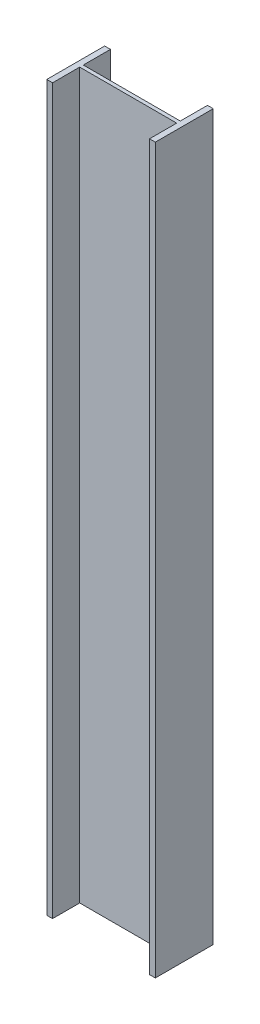
ISO-10303-21;
HEADER;
FILE_DESCRIPTION(('STEP AP214'),'2;1');
FILE_NAME('part.step','',(''),(''),'','','');
FILE_SCHEMA(('AUTOMOTIVE_DESIGN { 1 0 10303 214 1 1 1 1 }'));
ENDSEC;
DATA;
#1=APPLICATION_CONTEXT('core data for automotive mechanical design processes');
#2=APPLICATION_PROTOCOL_DEFINITION('international standard','automotive_design',2000,#1);
#3=PRODUCT_CONTEXT('',#1,'mechanical');
#4=PRODUCT('Part','Part','',(#3));
#5=PRODUCT_RELATED_PRODUCT_CATEGORY('part','',(#4));
#6=PRODUCT_DEFINITION_FORMATION('','',#4);
#7=PRODUCT_DEFINITION_CONTEXT('part definition',#1,'design');
#8=PRODUCT_DEFINITION('design','',#6,#7);
#9=PRODUCT_DEFINITION_SHAPE('','',#8);
#10=(LENGTH_UNIT() NAMED_UNIT(*) SI_UNIT(.MILLI.,.METRE.));
#11=(NAMED_UNIT(*) PLANE_ANGLE_UNIT() SI_UNIT($,.RADIAN.));
#12=(NAMED_UNIT(*) SI_UNIT($,.STERADIAN.) SOLID_ANGLE_UNIT());
#13=UNCERTAINTY_MEASURE_WITH_UNIT(LENGTH_MEASURE(1.E-05),#10,'distance_accuracy_value','');
#14=(GEOMETRIC_REPRESENTATION_CONTEXT(3) GLOBAL_UNCERTAINTY_ASSIGNED_CONTEXT((#13)) GLOBAL_UNIT_ASSIGNED_CONTEXT((#10,
#11,#12)) REPRESENTATION_CONTEXT('',''));
#15=CARTESIAN_POINT('',(0.,0.,0.));
#16=DIRECTION('',(0.,0.,1.));
#17=DIRECTION('',(1.,0.,0.));
#18=AXIS2_PLACEMENT_3D('',#15,#16,#17);
#19=CARTESIAN_POINT('',(67.,1000.,-2.5));
#20=DIRECTION('',(0.,0.,1.));
#21=DIRECTION('',(1.,0.,0.));
#22=AXIS2_PLACEMENT_3D('',#19,#20,#21);
#23=PLANE('',#22);
#24=DIRECTION('',(-1.,0.,0.));
#25=VECTOR('',#24,1.);
#26=CARTESIAN_POINT('',(67.,0.,-2.5));
#27=LINE('',#26,#25);
#28=CARTESIAN_POINT('',(67.,0.,-2.5));
#29=VERTEX_POINT('',#28);
#30=CARTESIAN_POINT('',(-67.,0.,-2.5));
#31=VERTEX_POINT('',#30);
#32=EDGE_CURVE('E156',#29,#31,#27,.T.);
#33=ORIENTED_EDGE('',*,*,#32,.T.);
#34=DIRECTION('',(0.,-1.,0.));
#35=VECTOR('',#34,1.);
#36=CARTESIAN_POINT('',(-67.,1000.,-2.5));
#37=LINE('',#36,#35);
#38=CARTESIAN_POINT('',(-67.,1000.,-2.5));
#39=VERTEX_POINT('',#38);
#40=EDGE_CURVE('E11',#39,#31,#37,.T.);
#41=ORIENTED_EDGE('',*,*,#40,.F.);
#42=DIRECTION('',(-1.,0.,0.));
#43=VECTOR('',#42,1.);
#44=CARTESIAN_POINT('',(67.,1000.,-2.5));
#45=LINE('',#44,#43);
#46=CARTESIAN_POINT('',(67.,1000.,-2.5));
#47=VERTEX_POINT('',#46);
#48=EDGE_CURVE('E178',#47,#39,#45,.T.);
#49=ORIENTED_EDGE('',*,*,#48,.F.);
#50=DIRECTION('',(0.,-1.,0.));
#51=VECTOR('',#50,1.);
#52=CARTESIAN_POINT('',(67.,1000.,-2.5));
#53=LINE('',#52,#51);
#54=EDGE_CURVE('E152',#47,#29,#53,.T.);
#55=ORIENTED_EDGE('',*,*,#54,.T.);
#56=EDGE_LOOP('',(#33,#41,#49,#55));
#57=FACE_BOUND('',#56,.T.);
#58=ADVANCED_FACE('F36',(#57),#23,.F.);
#59=CARTESIAN_POINT('',(-67.,1000.,-2.5));
#60=DIRECTION('',(-1.,0.,0.));
#61=DIRECTION('',(0.,0.,1.));
#62=AXIS2_PLACEMENT_3D('',#59,#60,#61);
#63=PLANE('',#62);
#64=DIRECTION('',(0.,0.,-1.));
#65=VECTOR('',#64,1.);
#66=CARTESIAN_POINT('',(-67.,0.,-2.5));
#67=LINE('',#66,#65);
#68=CARTESIAN_POINT('',(-67.,0.,-40.));
#69=VERTEX_POINT('',#68);
#70=EDGE_CURVE('E159',#31,#69,#67,.T.);
#71=ORIENTED_EDGE('',*,*,#70,.T.);
#72=DIRECTION('',(0.,-1.,0.));
#73=VECTOR('',#72,1.);
#74=CARTESIAN_POINT('',(-67.,1000.,-40.));
#75=LINE('',#74,#73);
#76=CARTESIAN_POINT('',(-67.,1000.,-40.));
#77=VERTEX_POINT('',#76);
#78=EDGE_CURVE('E44',#77,#69,#75,.T.);
#79=ORIENTED_EDGE('',*,*,#78,.F.);
#80=DIRECTION('',(0.,0.,-1.));
#81=VECTOR('',#80,1.);
#82=CARTESIAN_POINT('',(-67.,1000.,-2.5));
#83=LINE('',#82,#81);
#84=EDGE_CURVE('E107',#39,#77,#83,.T.);
#85=ORIENTED_EDGE('',*,*,#84,.F.);
#86=ORIENTED_EDGE('',*,*,#40,.T.);
#87=EDGE_LOOP('',(#71,#79,#85,#86));
#88=FACE_BOUND('',#87,.T.);
#89=ADVANCED_FACE('F256',(#88),#63,.F.);
#90=CARTESIAN_POINT('',(-67.,1000.,-40.));
#91=DIRECTION('',(0.,0.,1.));
#92=DIRECTION('',(1.,0.,0.));
#93=AXIS2_PLACEMENT_3D('',#90,#91,#92);
#94=PLANE('',#93);
#95=DIRECTION('',(-1.,0.,0.));
#96=VECTOR('',#95,1.);
#97=CARTESIAN_POINT('',(-67.,0.,-40.));
#98=LINE('',#97,#96);
#99=CARTESIAN_POINT('',(-75.,0.,-40.));
#100=VERTEX_POINT('',#99);
#101=EDGE_CURVE('E161',#69,#100,#98,.T.);
#102=ORIENTED_EDGE('',*,*,#101,.T.);
#103=DIRECTION('',(0.,-1.,0.));
#104=VECTOR('',#103,1.);
#105=CARTESIAN_POINT('',(-75.,1000.,-40.));
#106=LINE('',#105,#104);
#107=CARTESIAN_POINT('',(-75.,1000.,-40.));
#108=VERTEX_POINT('',#107);
#109=EDGE_CURVE('E197',#108,#100,#106,.T.);
#110=ORIENTED_EDGE('',*,*,#109,.F.);
#111=DIRECTION('',(-1.,0.,0.));
#112=VECTOR('',#111,1.);
#113=CARTESIAN_POINT('',(-67.,1000.,-40.));
#114=LINE('',#113,#112);
#115=EDGE_CURVE('E205',#77,#108,#114,.T.);
#116=ORIENTED_EDGE('',*,*,#115,.F.);
#117=ORIENTED_EDGE('',*,*,#78,.T.);
#118=EDGE_LOOP('',(#102,#110,#116,#117));
#119=FACE_BOUND('',#118,.T.);
#120=ADVANCED_FACE('F203',(#119),#94,.F.);
#121=CARTESIAN_POINT('',(-75.,1000.,-40.));
#122=DIRECTION('',(1.,0.,0.));
#123=DIRECTION('',(0.,0.,-1.));
#124=AXIS2_PLACEMENT_3D('',#121,#122,#123);
#125=PLANE('',#124);
#126=DIRECTION('',(0.,0.,1.));
#127=VECTOR('',#126,1.);
#128=CARTESIAN_POINT('',(-75.,0.,-40.));
#129=LINE('',#128,#127);
#130=CARTESIAN_POINT('',(-75.,0.,40.));
#131=VERTEX_POINT('',#130);
#132=EDGE_CURVE('E163',#100,#131,#129,.T.);
#133=ORIENTED_EDGE('',*,*,#132,.T.);
#134=DIRECTION('',(0.,-1.,0.));
#135=VECTOR('',#134,1.);
#136=CARTESIAN_POINT('',(-75.,1000.,40.));
#137=LINE('',#136,#135);
#138=CARTESIAN_POINT('',(-75.,1000.,40.));
#139=VERTEX_POINT('',#138);
#140=EDGE_CURVE('E194',#139,#131,#137,.T.);
#141=ORIENTED_EDGE('',*,*,#140,.F.);
#142=DIRECTION('',(0.,0.,1.));
#143=VECTOR('',#142,1.);
#144=CARTESIAN_POINT('',(-75.,1000.,-40.));
#145=LINE('',#144,#143);
#146=EDGE_CURVE('E223',#108,#139,#145,.T.);
#147=ORIENTED_EDGE('',*,*,#146,.F.);
#148=ORIENTED_EDGE('',*,*,#109,.T.);
#149=EDGE_LOOP('',(#133,#141,#147,#148));
#150=FACE_BOUND('',#149,.T.);
#151=ADVANCED_FACE('F214',(#150),#125,.F.);
#152=CARTESIAN_POINT('',(-75.,1000.,40.));
#153=DIRECTION('',(0.,0.,-1.));
#154=DIRECTION('',(-1.,0.,0.));
#155=AXIS2_PLACEMENT_3D('',#152,#153,#154);
#156=PLANE('',#155);
#157=DIRECTION('',(1.,0.,0.));
#158=VECTOR('',#157,1.);
#159=CARTESIAN_POINT('',(-75.,0.,40.));
#160=LINE('',#159,#158);
#161=CARTESIAN_POINT('',(-67.,0.,40.));
#162=VERTEX_POINT('',#161);
#163=EDGE_CURVE('E165',#131,#162,#160,.T.);
#164=ORIENTED_EDGE('',*,*,#163,.T.);
#165=DIRECTION('',(0.,-1.,0.));
#166=VECTOR('',#165,1.);
#167=CARTESIAN_POINT('',(-67.,1000.,40.));
#168=LINE('',#167,#166);
#169=CARTESIAN_POINT('',(-67.,1000.,40.));
#170=VERTEX_POINT('',#169);
#171=EDGE_CURVE('E191',#170,#162,#168,.T.);
#172=ORIENTED_EDGE('',*,*,#171,.F.);
#173=DIRECTION('',(1.,0.,0.));
#174=VECTOR('',#173,1.);
#175=CARTESIAN_POINT('',(-75.,1000.,40.));
#176=LINE('',#175,#174);
#177=EDGE_CURVE('E220',#139,#170,#176,.T.);
#178=ORIENTED_EDGE('',*,*,#177,.F.);
#179=ORIENTED_EDGE('',*,*,#140,.T.);
#180=EDGE_LOOP('',(#164,#172,#178,#179));
#181=FACE_BOUND('',#180,.T.);
#182=ADVANCED_FACE('F218',(#181),#156,.F.);
#183=CARTESIAN_POINT('',(-67.,1000.,40.));
#184=DIRECTION('',(-1.,0.,0.));
#185=DIRECTION('',(0.,0.,1.));
#186=AXIS2_PLACEMENT_3D('',#183,#184,#185);
#187=PLANE('',#186);
#188=DIRECTION('',(0.,0.,-1.));
#189=VECTOR('',#188,1.);
#190=CARTESIAN_POINT('',(-67.,0.,40.));
#191=LINE('',#190,#189);
#192=CARTESIAN_POINT('',(-67.,0.,2.5));
#193=VERTEX_POINT('',#192);
#194=EDGE_CURVE('E167',#162,#193,#191,.T.);
#195=ORIENTED_EDGE('',*,*,#194,.T.);
#196=DIRECTION('',(0.,-1.,0.));
#197=VECTOR('',#196,1.);
#198=CARTESIAN_POINT('',(-67.,1000.,2.5));
#199=LINE('',#198,#197);
#200=CARTESIAN_POINT('',(-67.,1000.,2.5));
#201=VERTEX_POINT('',#200);
#202=EDGE_CURVE('E188',#201,#193,#199,.T.);
#203=ORIENTED_EDGE('',*,*,#202,.F.);
#204=DIRECTION('',(0.,0.,-1.));
#205=VECTOR('',#204,1.);
#206=CARTESIAN_POINT('',(-67.,1000.,40.));
#207=LINE('',#206,#205);
#208=EDGE_CURVE('E222',#170,#201,#207,.T.);
#209=ORIENTED_EDGE('',*,*,#208,.F.);
#210=ORIENTED_EDGE('',*,*,#171,.T.);
#211=EDGE_LOOP('',(#195,#203,#209,#210));
#212=FACE_BOUND('',#211,.T.);
#213=ADVANCED_FACE('F269',(#212),#187,.F.);
#214=CARTESIAN_POINT('',(-67.,1000.,2.5));
#215=DIRECTION('',(0.,0.,-1.));
#216=DIRECTION('',(-1.,0.,0.));
#217=AXIS2_PLACEMENT_3D('',#214,#215,#216);
#218=PLANE('',#217);
#219=DIRECTION('',(1.,0.,0.));
#220=VECTOR('',#219,1.);
#221=CARTESIAN_POINT('',(-67.,0.,2.5));
#222=LINE('',#221,#220);
#223=CARTESIAN_POINT('',(67.,0.,2.5));
#224=VERTEX_POINT('',#223);
#225=EDGE_CURVE('E169',#193,#224,#222,.T.);
#226=ORIENTED_EDGE('',*,*,#225,.T.);
#227=DIRECTION('',(0.,-1.,0.));
#228=VECTOR('',#227,1.);
#229=CARTESIAN_POINT('',(67.,1000.,2.5));
#230=LINE('',#229,#228);
#231=CARTESIAN_POINT('',(67.,1000.,2.5));
#232=VERTEX_POINT('',#231);
#233=EDGE_CURVE('E185',#232,#224,#230,.T.);
#234=ORIENTED_EDGE('',*,*,#233,.F.);
#235=DIRECTION('',(1.,0.,0.));
#236=VECTOR('',#235,1.);
#237=CARTESIAN_POINT('',(-67.,1000.,2.5));
#238=LINE('',#237,#236);
#239=EDGE_CURVE('E225',#201,#232,#238,.T.);
#240=ORIENTED_EDGE('',*,*,#239,.F.);
#241=ORIENTED_EDGE('',*,*,#202,.T.);
#242=EDGE_LOOP('',(#226,#234,#240,#241));
#243=FACE_BOUND('',#242,.T.);
#244=ADVANCED_FACE('F272',(#243),#218,.F.);
#245=CARTESIAN_POINT('',(67.,1000.,2.5));
#246=DIRECTION('',(1.,0.,0.));
#247=DIRECTION('',(0.,0.,-1.));
#248=AXIS2_PLACEMENT_3D('',#245,#246,#247);
#249=PLANE('',#248);
#250=DIRECTION('',(0.,0.,1.));
#251=VECTOR('',#250,1.);
#252=CARTESIAN_POINT('',(67.,0.,2.5));
#253=LINE('',#252,#251);
#254=CARTESIAN_POINT('',(67.,0.,40.));
#255=VERTEX_POINT('',#254);
#256=EDGE_CURVE('E171',#224,#255,#253,.T.);
#257=ORIENTED_EDGE('',*,*,#256,.T.);
#258=DIRECTION('',(0.,-1.,0.));
#259=VECTOR('',#258,1.);
#260=CARTESIAN_POINT('',(67.,1000.,40.));
#261=LINE('',#260,#259);
#262=CARTESIAN_POINT('',(67.,1000.,40.));
#263=VERTEX_POINT('',#262);
#264=EDGE_CURVE('E182',#263,#255,#261,.T.);
#265=ORIENTED_EDGE('',*,*,#264,.F.);
#266=DIRECTION('',(0.,0.,1.));
#267=VECTOR('',#266,1.);
#268=CARTESIAN_POINT('',(67.,1000.,2.5));
#269=LINE('',#268,#267);
#270=EDGE_CURVE('E231',#232,#263,#269,.T.);
#271=ORIENTED_EDGE('',*,*,#270,.F.);
#272=ORIENTED_EDGE('',*,*,#233,.T.);
#273=EDGE_LOOP('',(#257,#265,#271,#272));
#274=FACE_BOUND('',#273,.T.);
#275=ADVANCED_FACE('F237',(#274),#249,.F.);
#276=CARTESIAN_POINT('',(67.,1000.,40.));
#277=DIRECTION('',(0.,0.,-1.));
#278=DIRECTION('',(-1.,0.,0.));
#279=AXIS2_PLACEMENT_3D('',#276,#277,#278);
#280=PLANE('',#279);
#281=DIRECTION('',(1.,0.,0.));
#282=VECTOR('',#281,1.);
#283=CARTESIAN_POINT('',(67.,0.,40.));
#284=LINE('',#283,#282);
#285=CARTESIAN_POINT('',(75.,0.,40.));
#286=VERTEX_POINT('',#285);
#287=EDGE_CURVE('E173',#255,#286,#284,.T.);
#288=ORIENTED_EDGE('',*,*,#287,.T.);
#289=DIRECTION('',(0.,-1.,0.));
#290=VECTOR('',#289,1.);
#291=CARTESIAN_POINT('',(75.,1000.,40.));
#292=LINE('',#291,#290);
#293=CARTESIAN_POINT('',(75.,1000.,40.));
#294=VERTEX_POINT('',#293);
#295=EDGE_CURVE('E147',#294,#286,#292,.T.);
#296=ORIENTED_EDGE('',*,*,#295,.F.);
#297=DIRECTION('',(1.,0.,0.));
#298=VECTOR('',#297,1.);
#299=CARTESIAN_POINT('',(67.,1000.,40.));
#300=LINE('',#299,#298);
#301=EDGE_CURVE('E138',#263,#294,#300,.T.);
#302=ORIENTED_EDGE('',*,*,#301,.F.);
#303=ORIENTED_EDGE('',*,*,#264,.T.);
#304=EDGE_LOOP('',(#288,#296,#302,#303));
#305=FACE_BOUND('',#304,.T.);
#306=ADVANCED_FACE('F241',(#305),#280,.F.);
#307=CARTESIAN_POINT('',(75.,1000.,40.));
#308=DIRECTION('',(-1.,0.,0.));
#309=DIRECTION('',(0.,0.,1.));
#310=AXIS2_PLACEMENT_3D('',#307,#308,#309);
#311=PLANE('',#310);
#312=DIRECTION('',(0.,0.,-1.));
#313=VECTOR('',#312,1.);
#314=CARTESIAN_POINT('',(75.,0.,40.));
#315=LINE('',#314,#313);
#316=CARTESIAN_POINT('',(75.,0.,-40.));
#317=VERTEX_POINT('',#316);
#318=EDGE_CURVE('E146',#286,#317,#315,.T.);
#319=ORIENTED_EDGE('',*,*,#318,.T.);
#320=DIRECTION('',(0.,-1.,0.));
#321=VECTOR('',#320,1.);
#322=CARTESIAN_POINT('',(75.,1000.,-40.));
#323=LINE('',#322,#321);
#324=CARTESIAN_POINT('',(75.,1000.,-40.));
#325=VERTEX_POINT('',#324);
#326=EDGE_CURVE('E143',#325,#317,#323,.T.);
#327=ORIENTED_EDGE('',*,*,#326,.F.);
#328=DIRECTION('',(0.,0.,-1.));
#329=VECTOR('',#328,1.);
#330=CARTESIAN_POINT('',(75.,1000.,40.));
#331=LINE('',#330,#329);
#332=EDGE_CURVE('E132',#294,#325,#331,.T.);
#333=ORIENTED_EDGE('',*,*,#332,.F.);
#334=ORIENTED_EDGE('',*,*,#295,.T.);
#335=EDGE_LOOP('',(#319,#327,#333,#334));
#336=FACE_BOUND('',#335,.T.);
#337=ADVANCED_FACE('F144',(#336),#311,.F.);
#338=CARTESIAN_POINT('',(75.,1000.,-40.));
#339=DIRECTION('',(0.,0.,1.));
#340=DIRECTION('',(1.,0.,0.));
#341=AXIS2_PLACEMENT_3D('',#338,#339,#340);
#342=PLANE('',#341);
#343=DIRECTION('',(-1.,0.,0.));
#344=VECTOR('',#343,1.);
#345=CARTESIAN_POINT('',(75.,0.,-40.));
#346=LINE('',#345,#344);
#347=CARTESIAN_POINT('',(67.,0.,-40.));
#348=VERTEX_POINT('',#347);
#349=EDGE_CURVE('E93',#317,#348,#346,.T.);
#350=ORIENTED_EDGE('',*,*,#349,.T.);
#351=DIRECTION('',(0.,-1.,0.));
#352=VECTOR('',#351,1.);
#353=CARTESIAN_POINT('',(67.,1000.,-40.));
#354=LINE('',#353,#352);
#355=CARTESIAN_POINT('',(67.,1000.,-40.));
#356=VERTEX_POINT('',#355);
#357=EDGE_CURVE('E148',#356,#348,#354,.T.);
#358=ORIENTED_EDGE('',*,*,#357,.F.);
#359=DIRECTION('',(-1.,0.,0.));
#360=VECTOR('',#359,1.);
#361=CARTESIAN_POINT('',(75.,1000.,-40.));
#362=LINE('',#361,#360);
#363=EDGE_CURVE('E136',#325,#356,#362,.T.);
#364=ORIENTED_EDGE('',*,*,#363,.F.);
#365=ORIENTED_EDGE('',*,*,#326,.T.);
#366=EDGE_LOOP('',(#350,#358,#364,#365));
#367=FACE_BOUND('',#366,.T.);
#368=ADVANCED_FACE('F150',(#367),#342,.F.);
#369=CARTESIAN_POINT('',(67.,1000.,-40.));
#370=DIRECTION('',(1.,0.,0.));
#371=DIRECTION('',(0.,0.,-1.));
#372=AXIS2_PLACEMENT_3D('',#369,#370,#371);
#373=PLANE('',#372);
#374=DIRECTION('',(0.,0.,1.));
#375=VECTOR('',#374,1.);
#376=CARTESIAN_POINT('',(67.,0.,-40.));
#377=LINE('',#376,#375);
#378=EDGE_CURVE('E99',#348,#29,#377,.T.);
#379=ORIENTED_EDGE('',*,*,#378,.T.);
#380=ORIENTED_EDGE('',*,*,#54,.F.);
#381=DIRECTION('',(0.,0.,1.));
#382=VECTOR('',#381,1.);
#383=CARTESIAN_POINT('',(67.,1000.,-40.));
#384=LINE('',#383,#382);
#385=EDGE_CURVE('E52',#356,#47,#384,.T.);
#386=ORIENTED_EDGE('',*,*,#385,.F.);
#387=ORIENTED_EDGE('',*,*,#357,.T.);
#388=EDGE_LOOP('',(#379,#380,#386,#387));
#389=FACE_BOUND('',#388,.T.);
#390=ADVANCED_FACE('F245',(#389),#373,.F.);
#391=CARTESIAN_POINT('',(0.,1000.,0.));
#392=DIRECTION('',(0.,-1.,0.));
#393=DIRECTION('',(0.,0.,-1.));
#394=AXIS2_PLACEMENT_3D('',#391,#392,#393);
#395=PLANE('',#394);
#396=ORIENTED_EDGE('',*,*,#48,.T.);
#397=ORIENTED_EDGE('',*,*,#84,.T.);
#398=ORIENTED_EDGE('',*,*,#115,.T.);
#399=ORIENTED_EDGE('',*,*,#146,.T.);
#400=ORIENTED_EDGE('',*,*,#177,.T.);
#401=ORIENTED_EDGE('',*,*,#208,.T.);
#402=ORIENTED_EDGE('',*,*,#239,.T.);
#403=ORIENTED_EDGE('',*,*,#270,.T.);
#404=ORIENTED_EDGE('',*,*,#301,.T.);
#405=ORIENTED_EDGE('',*,*,#332,.T.);
#406=ORIENTED_EDGE('',*,*,#363,.T.);
#407=ORIENTED_EDGE('',*,*,#385,.T.);
#408=EDGE_LOOP('',(#396,#397,#398,#399,#400,#401,#402,#403,#404,#405,#406,#407));
#409=FACE_BOUND('',#408,.T.);
#410=ADVANCED_FACE('F134',(#409),#395,.F.);
#411=CARTESIAN_POINT('',(0.,0.,0.));
#412=DIRECTION('',(0.,-1.,0.));
#413=DIRECTION('',(0.,0.,-1.));
#414=AXIS2_PLACEMENT_3D('',#411,#412,#413);
#415=PLANE('',#414);
#416=ORIENTED_EDGE('',*,*,#32,.F.);
#417=ORIENTED_EDGE('',*,*,#378,.F.);
#418=ORIENTED_EDGE('',*,*,#349,.F.);
#419=ORIENTED_EDGE('',*,*,#318,.F.);
#420=ORIENTED_EDGE('',*,*,#287,.F.);
#421=ORIENTED_EDGE('',*,*,#256,.F.);
#422=ORIENTED_EDGE('',*,*,#225,.F.);
#423=ORIENTED_EDGE('',*,*,#194,.F.);
#424=ORIENTED_EDGE('',*,*,#163,.F.);
#425=ORIENTED_EDGE('',*,*,#132,.F.);
#426=ORIENTED_EDGE('',*,*,#101,.F.);
#427=ORIENTED_EDGE('',*,*,#70,.F.);
#428=EDGE_LOOP('',(#416,#417,#418,#419,#420,#421,#422,#423,#424,#425,#426,#427));
#429=FACE_BOUND('',#428,.T.);
#430=ADVANCED_FACE('F209',(#429),#415,.T.);
#431=CLOSED_SHELL('',(#58,#89,#120,#151,#182,#213,#244,#275,#306,#337,#368,#390,#410,#430));
#432=MANIFOLD_SOLID_BREP('B2',#431);
#433=ADVANCED_BREP_SHAPE_REPRESENTATION('',(#18,#432),#14);
#434=SHAPE_DEFINITION_REPRESENTATION(#9,#433);
ENDSEC;
END-ISO-10303-21;
